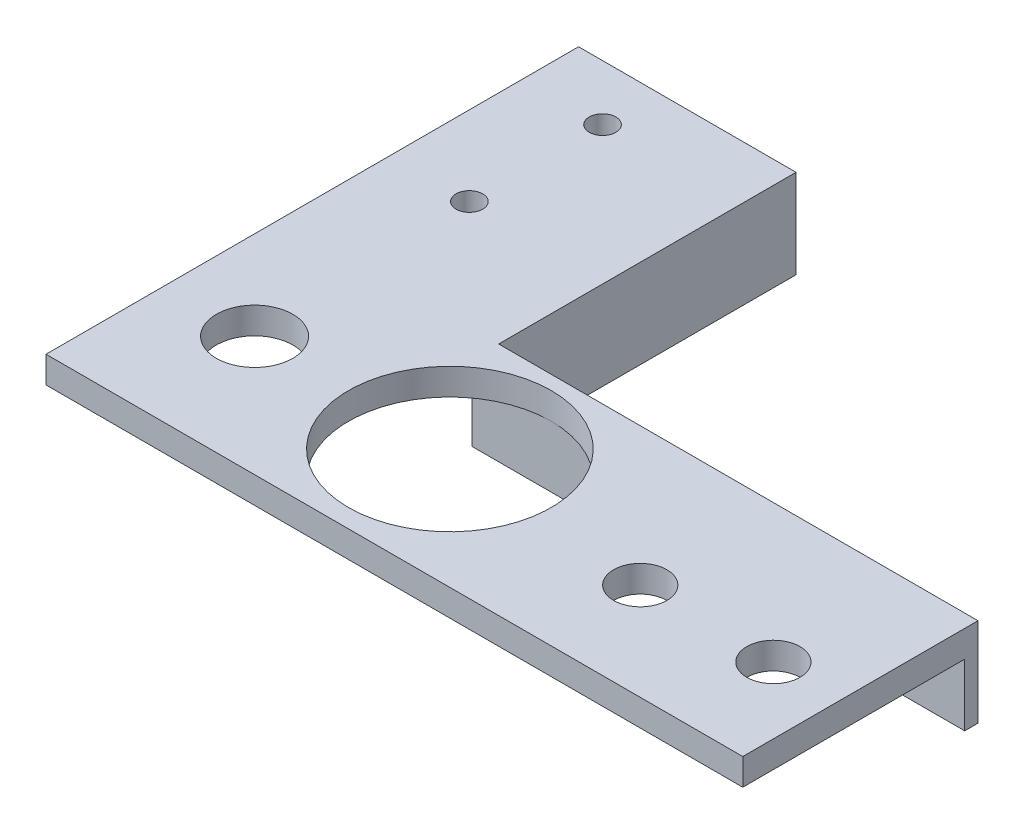
ISO-10303-21;
HEADER;
FILE_DESCRIPTION(('STEP AP214'),'2;1');
FILE_NAME('part.step','',(''),(''),'','','');
FILE_SCHEMA(('AUTOMOTIVE_DESIGN { 1 0 10303 214 1 1 1 1 }'));
ENDSEC;
DATA;
#1=APPLICATION_CONTEXT('core data for automotive mechanical design processes');
#2=APPLICATION_PROTOCOL_DEFINITION('international standard','automotive_design',2000,#1);
#3=PRODUCT_CONTEXT('',#1,'mechanical');
#4=PRODUCT('Part','Part','',(#3));
#5=PRODUCT_RELATED_PRODUCT_CATEGORY('part','',(#4));
#6=PRODUCT_DEFINITION_FORMATION('','',#4);
#7=PRODUCT_DEFINITION_CONTEXT('part definition',#1,'design');
#8=PRODUCT_DEFINITION('design','',#6,#7);
#9=PRODUCT_DEFINITION_SHAPE('','',#8);
#10=(LENGTH_UNIT() NAMED_UNIT(*) SI_UNIT(.MILLI.,.METRE.));
#11=(NAMED_UNIT(*) PLANE_ANGLE_UNIT() SI_UNIT($,.RADIAN.));
#12=(NAMED_UNIT(*) SI_UNIT($,.STERADIAN.) SOLID_ANGLE_UNIT());
#13=UNCERTAINTY_MEASURE_WITH_UNIT(LENGTH_MEASURE(1.E-05),#10,'distance_accuracy_value','');
#14=(GEOMETRIC_REPRESENTATION_CONTEXT(3) GLOBAL_UNCERTAINTY_ASSIGNED_CONTEXT((#13)) GLOBAL_UNIT_ASSIGNED_CONTEXT((#10,
#11,#12)) REPRESENTATION_CONTEXT('',''));
#15=CARTESIAN_POINT('',(0.,0.,0.));
#16=DIRECTION('',(0.,0.,1.));
#17=DIRECTION('',(1.,0.,0.));
#18=AXIS2_PLACEMENT_3D('',#15,#16,#17);
#19=CARTESIAN_POINT('',(39.25,3.,29.));
#20=DIRECTION('',(-1.,0.,0.));
#21=DIRECTION('',(0.,0.,1.));
#22=AXIS2_PLACEMENT_3D('',#19,#20,#21);
#23=PLANE('',#22);
#24=DIRECTION('',(0.,0.,-1.));
#25=VECTOR('',#24,1.);
#26=CARTESIAN_POINT('',(39.25,0.,29.));
#27=LINE('',#26,#25);
#28=CARTESIAN_POINT('',(39.25,0.,31.));
#29=VERTEX_POINT('',#28);
#30=CARTESIAN_POINT('',(39.25,0.,6.));
#31=VERTEX_POINT('',#30);
#32=EDGE_CURVE('E86',#29,#31,#27,.T.);
#33=ORIENTED_EDGE('',*,*,#32,.T.);
#34=DIRECTION('',(0.,1.,0.));
#35=VECTOR('',#34,1.);
#36=CARTESIAN_POINT('',(39.25,-7.,6.));
#37=LINE('',#36,#35);
#38=CARTESIAN_POINT('',(39.25,-7.,6.));
#39=VERTEX_POINT('',#38);
#40=EDGE_CURVE('E85',#39,#31,#37,.T.);
#41=ORIENTED_EDGE('',*,*,#40,.F.);
#42=DIRECTION('',(0.,0.,-1.));
#43=VECTOR('',#42,1.);
#44=CARTESIAN_POINT('',(39.25,-7.,6.));
#45=LINE('',#44,#43);
#46=CARTESIAN_POINT('',(39.25,-7.,4.5));
#47=VERTEX_POINT('',#46);
#48=EDGE_CURVE('E159',#39,#47,#45,.T.);
#49=ORIENTED_EDGE('',*,*,#48,.T.);
#50=DIRECTION('',(0.,1.,0.));
#51=VECTOR('',#50,1.);
#52=CARTESIAN_POINT('',(39.25,-7.,4.5));
#53=LINE('',#52,#51);
#54=CARTESIAN_POINT('',(39.25,3.,4.5));
#55=VERTEX_POINT('',#54);
#56=EDGE_CURVE('E94',#47,#55,#53,.T.);
#57=ORIENTED_EDGE('',*,*,#56,.T.);
#58=DIRECTION('',(0.,0.,-1.));
#59=VECTOR('',#58,1.);
#60=CARTESIAN_POINT('',(39.25,3.,29.));
#61=LINE('',#60,#59);
#62=CARTESIAN_POINT('',(39.25,3.,31.));
#63=VERTEX_POINT('',#62);
#64=EDGE_CURVE('E125',#63,#55,#61,.T.);
#65=ORIENTED_EDGE('',*,*,#64,.F.);
#66=DIRECTION('',(0.,1.,0.));
#67=VECTOR('',#66,1.);
#68=CARTESIAN_POINT('',(39.25,0.,31.));
#69=LINE('',#68,#67);
#70=EDGE_CURVE('E149',#29,#63,#69,.T.);
#71=ORIENTED_EDGE('',*,*,#70,.F.);
#72=EDGE_LOOP('',(#33,#41,#49,#57,#65,#71));
#73=FACE_BOUND('',#72,.T.);
#74=ADVANCED_FACE('F32',(#73),#23,.F.);
#75=CARTESIAN_POINT('',(-16.25,3.,-29.));
#76=DIRECTION('',(0.,0.,1.));
#77=DIRECTION('',(1.,0.,0.));
#78=AXIS2_PLACEMENT_3D('',#75,#76,#77);
#79=PLANE('',#78);
#80=DIRECTION('',(-1.,0.,0.));
#81=VECTOR('',#80,1.);
#82=CARTESIAN_POINT('',(-16.25,0.,-29.));
#83=LINE('',#82,#81);
#84=CARTESIAN_POINT('',(-16.25,0.,-29.));
#85=VERTEX_POINT('',#84);
#86=CARTESIAN_POINT('',(-39.25,0.,-29.));
#87=VERTEX_POINT('',#86);
#88=EDGE_CURVE('E71',#85,#87,#83,.T.);
#89=ORIENTED_EDGE('',*,*,#88,.T.);
#90=DIRECTION('',(0.,-1.,0.));
#91=VECTOR('',#90,1.);
#92=CARTESIAN_POINT('',(-39.25,3.,-29.));
#93=LINE('',#92,#91);
#94=CARTESIAN_POINT('',(-39.25,3.,-29.));
#95=VERTEX_POINT('',#94);
#96=EDGE_CURVE('E11',#95,#87,#93,.T.);
#97=ORIENTED_EDGE('',*,*,#96,.F.);
#98=DIRECTION('',(-1.,0.,0.));
#99=VECTOR('',#98,1.);
#100=CARTESIAN_POINT('',(-16.25,3.,-29.));
#101=LINE('',#100,#99);
#102=CARTESIAN_POINT('',(-14.75,3.,-29.));
#103=VERTEX_POINT('',#102);
#104=EDGE_CURVE('E49',#103,#95,#101,.T.);
#105=ORIENTED_EDGE('',*,*,#104,.F.);
#106=DIRECTION('',(0.,1.,0.));
#107=VECTOR('',#106,1.);
#108=CARTESIAN_POINT('',(-14.75,-7.,-29.));
#109=LINE('',#108,#107);
#110=CARTESIAN_POINT('',(-14.75,-7.,-29.));
#111=VERTEX_POINT('',#110);
#112=EDGE_CURVE('E107',#111,#103,#109,.T.);
#113=ORIENTED_EDGE('',*,*,#112,.F.);
#114=DIRECTION('',(-1.,0.,0.));
#115=VECTOR('',#114,1.);
#116=CARTESIAN_POINT('',(-14.75,-7.,-29.));
#117=LINE('',#116,#115);
#118=CARTESIAN_POINT('',(-16.25,-7.,-29.));
#119=VERTEX_POINT('',#118);
#120=EDGE_CURVE('E153',#111,#119,#117,.T.);
#121=ORIENTED_EDGE('',*,*,#120,.T.);
#122=DIRECTION('',(0.,1.,0.));
#123=VECTOR('',#122,1.);
#124=CARTESIAN_POINT('',(-16.25,-7.,-29.));
#125=LINE('',#124,#123);
#126=EDGE_CURVE('E92',#119,#85,#125,.T.);
#127=ORIENTED_EDGE('',*,*,#126,.T.);
#128=EDGE_LOOP('',(#89,#97,#105,#113,#121,#127));
#129=FACE_BOUND('',#128,.T.);
#130=ADVANCED_FACE('F204',(#129),#79,.F.);
#131=CARTESIAN_POINT('',(-39.25,3.,-29.));
#132=DIRECTION('',(1.,0.,0.));
#133=DIRECTION('',(0.,0.,-1.));
#134=AXIS2_PLACEMENT_3D('',#131,#132,#133);
#135=PLANE('',#134);
#136=DIRECTION('',(0.,0.,1.));
#137=VECTOR('',#136,1.);
#138=CARTESIAN_POINT('',(-39.25,0.,-29.));
#139=LINE('',#138,#137);
#140=CARTESIAN_POINT('',(-39.25,0.,31.));
#141=VERTEX_POINT('',#140);
#142=EDGE_CURVE('E128',#87,#141,#139,.T.);
#143=ORIENTED_EDGE('',*,*,#142,.T.);
#144=DIRECTION('',(0.,-1.,0.));
#145=VECTOR('',#144,1.);
#146=CARTESIAN_POINT('',(-39.25,0.,31.));
#147=LINE('',#146,#145);
#148=CARTESIAN_POINT('',(-39.25,3.,31.));
#149=VERTEX_POINT('',#148);
#150=EDGE_CURVE('E226',#149,#141,#147,.T.);
#151=ORIENTED_EDGE('',*,*,#150,.F.);
#152=DIRECTION('',(0.,0.,1.));
#153=VECTOR('',#152,1.);
#154=CARTESIAN_POINT('',(-39.25,3.,-29.));
#155=LINE('',#154,#153);
#156=EDGE_CURVE('E41',#95,#149,#155,.T.);
#157=ORIENTED_EDGE('',*,*,#156,.F.);
#158=ORIENTED_EDGE('',*,*,#96,.T.);
#159=EDGE_LOOP('',(#143,#151,#157,#158));
#160=FACE_BOUND('',#159,.T.);
#161=ADVANCED_FACE('F250',(#160),#135,.F.);
#162=CARTESIAN_POINT('',(0.,3.,0.));
#163=DIRECTION('',(0.,1.,0.));
#164=DIRECTION('',(0.,0.,1.));
#165=AXIS2_PLACEMENT_3D('',#162,#163,#164);
#166=PLANE('',#165);
#167=CARTESIAN_POINT('',(-29.2499999999999,3.,17.5));
#168=DIRECTION('',(0.,1.,0.));
#169=DIRECTION('',(0.,0.,1.));
#170=AXIS2_PLACEMENT_3D('',#167,#168,#169);
#171=CIRCLE('',#170,4.30465448526568);
#172=CARTESIAN_POINT('',(-29.2499999999999,3.,21.8046544852657));
#173=VERTEX_POINT('',#172);
#174=EDGE_CURVE('E230',#173,#173,#171,.T.);
#175=ORIENTED_EDGE('',*,*,#174,.F.);
#176=EDGE_LOOP('',(#175));
#177=FACE_BOUND('',#176,.T.);
#178=CARTESIAN_POINT('',(-7.25000000000003,3.,17.4999999999999));
#179=DIRECTION('',(0.,1.,0.));
#180=DIRECTION('',(0.,0.,1.));
#181=AXIS2_PLACEMENT_3D('',#178,#179,#180);
#182=CIRCLE('',#181,11.4206212485819);
#183=CARTESIAN_POINT('',(-7.25000000000003,3.,28.9206212485818));
#184=VERTEX_POINT('',#183);
#185=EDGE_CURVE('E137',#184,#184,#182,.T.);
#186=ORIENTED_EDGE('',*,*,#185,.F.);
#187=EDGE_LOOP('',(#186));
#188=FACE_BOUND('',#187,.T.);
#189=CARTESIAN_POINT('',(-30.3,3.,-7.75));
#190=DIRECTION('',(0.,1.,0.));
#191=DIRECTION('',(0.,0.,1.));
#192=AXIS2_PLACEMENT_3D('',#189,#190,#191);
#193=CIRCLE('',#192,1.5);
#194=CARTESIAN_POINT('',(-30.3,3.,-6.25));
#195=VERTEX_POINT('',#194);
#196=EDGE_CURVE('E104',#195,#195,#193,.T.);
#197=ORIENTED_EDGE('',*,*,#196,.F.);
#198=EDGE_LOOP('',(#197));
#199=FACE_BOUND('',#198,.T.);
#200=CARTESIAN_POINT('',(-30.3,3.,-22.75));
#201=DIRECTION('',(0.,1.,0.));
#202=DIRECTION('',(0.,0.,1.));
#203=AXIS2_PLACEMENT_3D('',#200,#201,#202);
#204=CIRCLE('',#203,1.5);
#205=CARTESIAN_POINT('',(-30.3,3.,-21.25));
#206=VERTEX_POINT('',#205);
#207=EDGE_CURVE('E103',#206,#206,#204,.T.);
#208=ORIENTED_EDGE('',*,*,#207,.F.);
#209=EDGE_LOOP('',(#208));
#210=FACE_BOUND('',#209,.T.);
#211=CARTESIAN_POINT('',(16.75,3.,20.05));
#212=DIRECTION('',(0.,1.,0.));
#213=DIRECTION('',(0.,0.,1.));
#214=AXIS2_PLACEMENT_3D('',#211,#212,#213);
#215=CIRCLE('',#214,3.);
#216=CARTESIAN_POINT('',(16.75,3.,23.05));
#217=VERTEX_POINT('',#216);
#218=EDGE_CURVE('E111',#217,#217,#215,.T.);
#219=ORIENTED_EDGE('',*,*,#218,.F.);
#220=EDGE_LOOP('',(#219));
#221=FACE_BOUND('',#220,.T.);
#222=CARTESIAN_POINT('',(31.75,3.,20.05));
#223=DIRECTION('',(0.,1.,0.));
#224=DIRECTION('',(0.,0.,1.));
#225=AXIS2_PLACEMENT_3D('',#222,#223,#224);
#226=CIRCLE('',#225,3.);
#227=CARTESIAN_POINT('',(31.75,3.,23.05));
#228=VERTEX_POINT('',#227);
#229=EDGE_CURVE('E117',#228,#228,#226,.T.);
#230=ORIENTED_EDGE('',*,*,#229,.F.);
#231=EDGE_LOOP('',(#230));
#232=FACE_BOUND('',#231,.T.);
#233=ORIENTED_EDGE('',*,*,#156,.T.);
#234=DIRECTION('',(-1.,0.,0.));
#235=VECTOR('',#234,1.);
#236=CARTESIAN_POINT('',(-39.25,3.,31.));
#237=LINE('',#236,#235);
#238=EDGE_CURVE('E144',#63,#149,#237,.T.);
#239=ORIENTED_EDGE('',*,*,#238,.F.);
#240=ORIENTED_EDGE('',*,*,#64,.T.);
#241=DIRECTION('',(-1.,0.,0.));
#242=VECTOR('',#241,1.);
#243=CARTESIAN_POINT('',(39.25,3.,4.5));
#244=LINE('',#243,#242);
#245=CARTESIAN_POINT('',(-14.75,3.,4.50000000000001));
#246=VERTEX_POINT('',#245);
#247=EDGE_CURVE('E136',#55,#246,#244,.T.);
#248=ORIENTED_EDGE('',*,*,#247,.T.);
#249=DIRECTION('',(0.,0.,-1.));
#250=VECTOR('',#249,1.);
#251=CARTESIAN_POINT('',(-14.75,3.,4.50000000000001));
#252=LINE('',#251,#250);
#253=EDGE_CURVE('E141',#246,#103,#252,.T.);
#254=ORIENTED_EDGE('',*,*,#253,.T.);
#255=ORIENTED_EDGE('',*,*,#104,.T.);
#256=EDGE_LOOP('',(#233,#239,#240,#248,#254,#255));
#257=FACE_BOUND('',#256,.T.);
#258=ADVANCED_FACE('F191',(#177,#188,#199,#210,#221,#232,#257),#166,.T.);
#259=CARTESIAN_POINT('',(0.,0.,0.));
#260=DIRECTION('',(0.,1.,0.));
#261=DIRECTION('',(0.,0.,1.));
#262=AXIS2_PLACEMENT_3D('',#259,#260,#261);
#263=PLANE('',#262);
#264=CARTESIAN_POINT('',(-29.2499999999999,0.,17.5));
#265=DIRECTION('',(0.,1.,0.));
#266=DIRECTION('',(0.,0.,1.));
#267=AXIS2_PLACEMENT_3D('',#264,#265,#266);
#268=CIRCLE('',#267,4.30465448526568);
#269=CARTESIAN_POINT('',(-29.2499999999999,0.,21.8046544852657));
#270=VERTEX_POINT('',#269);
#271=EDGE_CURVE('E35',#270,#270,#268,.T.);
#272=ORIENTED_EDGE('',*,*,#271,.T.);
#273=EDGE_LOOP('',(#272));
#274=FACE_BOUND('',#273,.T.);
#275=CARTESIAN_POINT('',(-7.25000000000003,0.,17.4999999999999));
#276=DIRECTION('',(0.,1.,0.));
#277=DIRECTION('',(0.,0.,1.));
#278=AXIS2_PLACEMENT_3D('',#275,#276,#277);
#279=CIRCLE('',#278,11.4206212485819);
#280=CARTESIAN_POINT('',(-7.25000000000003,0.,28.9206212485818));
#281=VERTEX_POINT('',#280);
#282=EDGE_CURVE('E134',#281,#281,#279,.T.);
#283=ORIENTED_EDGE('',*,*,#282,.T.);
#284=EDGE_LOOP('',(#283));
#285=FACE_BOUND('',#284,.T.);
#286=CARTESIAN_POINT('',(-30.3,0.,-7.75));
#287=DIRECTION('',(0.,1.,0.));
#288=DIRECTION('',(0.,0.,1.));
#289=AXIS2_PLACEMENT_3D('',#286,#287,#288);
#290=CIRCLE('',#289,1.5);
#291=CARTESIAN_POINT('',(-30.3,0.,-6.25));
#292=VERTEX_POINT('',#291);
#293=EDGE_CURVE('E100',#292,#292,#290,.T.);
#294=ORIENTED_EDGE('',*,*,#293,.T.);
#295=EDGE_LOOP('',(#294));
#296=FACE_BOUND('',#295,.T.);
#297=CARTESIAN_POINT('',(-30.3,0.,-22.75));
#298=DIRECTION('',(0.,1.,0.));
#299=DIRECTION('',(0.,0.,1.));
#300=AXIS2_PLACEMENT_3D('',#297,#298,#299);
#301=CIRCLE('',#300,1.5);
#302=CARTESIAN_POINT('',(-30.3,0.,-21.25));
#303=VERTEX_POINT('',#302);
#304=EDGE_CURVE('E108',#303,#303,#301,.T.);
#305=ORIENTED_EDGE('',*,*,#304,.T.);
#306=EDGE_LOOP('',(#305));
#307=FACE_BOUND('',#306,.T.);
#308=CARTESIAN_POINT('',(16.75,0.,20.05));
#309=DIRECTION('',(0.,1.,0.));
#310=DIRECTION('',(0.,0.,1.));
#311=AXIS2_PLACEMENT_3D('',#308,#309,#310);
#312=CIRCLE('',#311,3.);
#313=CARTESIAN_POINT('',(16.75,0.,23.05));
#314=VERTEX_POINT('',#313);
#315=EDGE_CURVE('E114',#314,#314,#312,.T.);
#316=ORIENTED_EDGE('',*,*,#315,.T.);
#317=EDGE_LOOP('',(#316));
#318=FACE_BOUND('',#317,.T.);
#319=CARTESIAN_POINT('',(31.75,0.,20.05));
#320=DIRECTION('',(0.,1.,0.));
#321=DIRECTION('',(0.,0.,1.));
#322=AXIS2_PLACEMENT_3D('',#319,#320,#321);
#323=CIRCLE('',#322,3.);
#324=CARTESIAN_POINT('',(31.75,0.,23.05));
#325=VERTEX_POINT('',#324);
#326=EDGE_CURVE('E120',#325,#325,#323,.T.);
#327=ORIENTED_EDGE('',*,*,#326,.T.);
#328=EDGE_LOOP('',(#327));
#329=FACE_BOUND('',#328,.T.);
#330=ORIENTED_EDGE('',*,*,#32,.F.);
#331=DIRECTION('',(1.,0.,0.));
#332=VECTOR('',#331,1.);
#333=CARTESIAN_POINT('',(-39.25,0.,31.));
#334=LINE('',#333,#332);
#335=EDGE_CURVE('E220',#141,#29,#334,.T.);
#336=ORIENTED_EDGE('',*,*,#335,.F.);
#337=ORIENTED_EDGE('',*,*,#142,.F.);
#338=ORIENTED_EDGE('',*,*,#88,.F.);
#339=DIRECTION('',(0.,0.,-1.));
#340=VECTOR('',#339,1.);
#341=CARTESIAN_POINT('',(-16.25,0.,-29.));
#342=LINE('',#341,#340);
#343=CARTESIAN_POINT('',(-16.25,0.,6.));
#344=VERTEX_POINT('',#343);
#345=EDGE_CURVE('E64',#344,#85,#342,.T.);
#346=ORIENTED_EDGE('',*,*,#345,.F.);
#347=DIRECTION('',(-1.,0.,0.));
#348=VECTOR('',#347,1.);
#349=CARTESIAN_POINT('',(-16.25,0.,6.));
#350=LINE('',#349,#348);
#351=EDGE_CURVE('E68',#31,#344,#350,.T.);
#352=ORIENTED_EDGE('',*,*,#351,.F.);
#353=EDGE_LOOP('',(#330,#336,#337,#338,#346,#352));
#354=FACE_BOUND('',#353,.T.);
#355=ADVANCED_FACE('F67',(#274,#285,#296,#307,#318,#329,#354),#263,.F.);
#356=CARTESIAN_POINT('',(31.75,0.,20.05));
#357=DIRECTION('',(0.,1.,0.));
#358=DIRECTION('',(0.,0.,1.));
#359=AXIS2_PLACEMENT_3D('',#356,#357,#358);
#360=CYLINDRICAL_SURFACE('',#359,3.);
#361=ORIENTED_EDGE('',*,*,#326,.F.);
#362=EDGE_LOOP('',(#361));
#363=FACE_BOUND('',#362,.T.);
#364=ORIENTED_EDGE('',*,*,#229,.T.);
#365=EDGE_LOOP('',(#364));
#366=FACE_BOUND('',#365,.T.);
#367=ADVANCED_FACE('F259',(#363,#366),#360,.F.);
#368=CARTESIAN_POINT('',(16.75,0.,20.05));
#369=DIRECTION('',(0.,1.,0.));
#370=DIRECTION('',(0.,0.,1.));
#371=AXIS2_PLACEMENT_3D('',#368,#369,#370);
#372=CYLINDRICAL_SURFACE('',#371,3.);
#373=ORIENTED_EDGE('',*,*,#315,.F.);
#374=EDGE_LOOP('',(#373));
#375=FACE_BOUND('',#374,.T.);
#376=ORIENTED_EDGE('',*,*,#218,.T.);
#377=EDGE_LOOP('',(#376));
#378=FACE_BOUND('',#377,.T.);
#379=ADVANCED_FACE('F265',(#375,#378),#372,.F.);
#380=CARTESIAN_POINT('',(-30.3,0.,-22.75));
#381=DIRECTION('',(0.,1.,0.));
#382=DIRECTION('',(0.,0.,1.));
#383=AXIS2_PLACEMENT_3D('',#380,#381,#382);
#384=CYLINDRICAL_SURFACE('',#383,1.5);
#385=ORIENTED_EDGE('',*,*,#304,.F.);
#386=EDGE_LOOP('',(#385));
#387=FACE_BOUND('',#386,.T.);
#388=ORIENTED_EDGE('',*,*,#207,.T.);
#389=EDGE_LOOP('',(#388));
#390=FACE_BOUND('',#389,.T.);
#391=ADVANCED_FACE('F269',(#387,#390),#384,.F.);
#392=CARTESIAN_POINT('',(-30.3,0.,-7.75));
#393=DIRECTION('',(0.,1.,0.));
#394=DIRECTION('',(0.,0.,1.));
#395=AXIS2_PLACEMENT_3D('',#392,#393,#394);
#396=CYLINDRICAL_SURFACE('',#395,1.5);
#397=ORIENTED_EDGE('',*,*,#293,.F.);
#398=EDGE_LOOP('',(#397));
#399=FACE_BOUND('',#398,.T.);
#400=ORIENTED_EDGE('',*,*,#196,.T.);
#401=EDGE_LOOP('',(#400));
#402=FACE_BOUND('',#401,.T.);
#403=ADVANCED_FACE('F273',(#399,#402),#396,.F.);
#404=CARTESIAN_POINT('',(-16.25,-7.,6.));
#405=DIRECTION('',(0.,0.,1.));
#406=DIRECTION('',(1.,0.,0.));
#407=AXIS2_PLACEMENT_3D('',#404,#405,#406);
#408=PLANE('',#407);
#409=ORIENTED_EDGE('',*,*,#351,.T.);
#410=DIRECTION('',(0.,1.,0.));
#411=VECTOR('',#410,1.);
#412=CARTESIAN_POINT('',(-16.25,-7.,6.));
#413=LINE('',#412,#411);
#414=CARTESIAN_POINT('',(-16.25,-7.,6.));
#415=VERTEX_POINT('',#414);
#416=EDGE_CURVE('E82',#415,#344,#413,.T.);
#417=ORIENTED_EDGE('',*,*,#416,.F.);
#418=DIRECTION('',(1.,0.,0.));
#419=VECTOR('',#418,1.);
#420=CARTESIAN_POINT('',(-16.25,-7.,6.));
#421=LINE('',#420,#419);
#422=EDGE_CURVE('E157',#415,#39,#421,.T.);
#423=ORIENTED_EDGE('',*,*,#422,.T.);
#424=ORIENTED_EDGE('',*,*,#40,.T.);
#425=EDGE_LOOP('',(#409,#417,#423,#424));
#426=FACE_BOUND('',#425,.T.);
#427=ADVANCED_FACE('F79',(#426),#408,.T.);
#428=CARTESIAN_POINT('',(-16.25,-7.,-29.));
#429=DIRECTION('',(-1.,0.,0.));
#430=DIRECTION('',(0.,0.,1.));
#431=AXIS2_PLACEMENT_3D('',#428,#429,#430);
#432=PLANE('',#431);
#433=ORIENTED_EDGE('',*,*,#345,.T.);
#434=ORIENTED_EDGE('',*,*,#126,.F.);
#435=DIRECTION('',(0.,0.,1.));
#436=VECTOR('',#435,1.);
#437=CARTESIAN_POINT('',(-16.25,-7.,-29.));
#438=LINE('',#437,#436);
#439=EDGE_CURVE('E91',#119,#415,#438,.T.);
#440=ORIENTED_EDGE('',*,*,#439,.T.);
#441=ORIENTED_EDGE('',*,*,#416,.T.);
#442=EDGE_LOOP('',(#433,#434,#440,#441));
#443=FACE_BOUND('',#442,.T.);
#444=ADVANCED_FACE('F89',(#443),#432,.T.);
#445=CARTESIAN_POINT('',(-14.75,-7.,4.50000000000001));
#446=DIRECTION('',(1.,0.,0.));
#447=DIRECTION('',(0.,0.,-1.));
#448=AXIS2_PLACEMENT_3D('',#445,#446,#447);
#449=PLANE('',#448);
#450=ORIENTED_EDGE('',*,*,#253,.F.);
#451=DIRECTION('',(0.,1.,0.));
#452=VECTOR('',#451,1.);
#453=CARTESIAN_POINT('',(-14.75,-7.,4.50000000000001));
#454=LINE('',#453,#452);
#455=CARTESIAN_POINT('',(-14.75,-7.,4.50000000000001));
#456=VERTEX_POINT('',#455);
#457=EDGE_CURVE('E170',#456,#246,#454,.T.);
#458=ORIENTED_EDGE('',*,*,#457,.F.);
#459=DIRECTION('',(0.,0.,-1.));
#460=VECTOR('',#459,1.);
#461=CARTESIAN_POINT('',(-14.75,-7.,4.50000000000001));
#462=LINE('',#461,#460);
#463=EDGE_CURVE('E96',#456,#111,#462,.T.);
#464=ORIENTED_EDGE('',*,*,#463,.T.);
#465=ORIENTED_EDGE('',*,*,#112,.T.);
#466=EDGE_LOOP('',(#450,#458,#464,#465));
#467=FACE_BOUND('',#466,.T.);
#468=ADVANCED_FACE('F196',(#467),#449,.T.);
#469=CARTESIAN_POINT('',(39.25,-7.,4.5));
#470=DIRECTION('',(0.,0.,-1.));
#471=DIRECTION('',(-1.,0.,0.));
#472=AXIS2_PLACEMENT_3D('',#469,#470,#471);
#473=PLANE('',#472);
#474=ORIENTED_EDGE('',*,*,#247,.F.);
#475=ORIENTED_EDGE('',*,*,#56,.F.);
#476=DIRECTION('',(-1.,0.,0.));
#477=VECTOR('',#476,1.);
#478=CARTESIAN_POINT('',(39.25,-7.,4.5));
#479=LINE('',#478,#477);
#480=EDGE_CURVE('E162',#47,#456,#479,.T.);
#481=ORIENTED_EDGE('',*,*,#480,.T.);
#482=ORIENTED_EDGE('',*,*,#457,.T.);
#483=EDGE_LOOP('',(#474,#475,#481,#482));
#484=FACE_BOUND('',#483,.T.);
#485=ADVANCED_FACE('F188',(#484),#473,.T.);
#486=CARTESIAN_POINT('',(0.,-7.,0.));
#487=DIRECTION('',(0.,1.,0.));
#488=DIRECTION('',(0.,0.,1.));
#489=AXIS2_PLACEMENT_3D('',#486,#487,#488);
#490=PLANE('',#489);
#491=ORIENTED_EDGE('',*,*,#120,.F.);
#492=ORIENTED_EDGE('',*,*,#463,.F.);
#493=ORIENTED_EDGE('',*,*,#480,.F.);
#494=ORIENTED_EDGE('',*,*,#48,.F.);
#495=ORIENTED_EDGE('',*,*,#422,.F.);
#496=ORIENTED_EDGE('',*,*,#439,.F.);
#497=EDGE_LOOP('',(#491,#492,#493,#494,#495,#496));
#498=FACE_BOUND('',#497,.T.);
#499=ADVANCED_FACE('F207',(#498),#490,.F.);
#500=CARTESIAN_POINT('',(-7.25000000000003,-7.,17.4999999999999));
#501=DIRECTION('',(0.,1.,0.));
#502=DIRECTION('',(0.,0.,1.));
#503=AXIS2_PLACEMENT_3D('',#500,#501,#502);
#504=CYLINDRICAL_SURFACE('',#503,11.4206212485819);
#505=ORIENTED_EDGE('',*,*,#185,.T.);
#506=EDGE_LOOP('',(#505));
#507=FACE_BOUND('',#506,.T.);
#508=ORIENTED_EDGE('',*,*,#282,.F.);
#509=EDGE_LOOP('',(#508));
#510=FACE_BOUND('',#509,.T.);
#511=ADVANCED_FACE('F244',(#507,#510),#504,.F.);
#512=CARTESIAN_POINT('',(0.,0.,31.));
#513=DIRECTION('',(0.,0.,-1.));
#514=DIRECTION('',(-1.,0.,0.));
#515=AXIS2_PLACEMENT_3D('',#512,#513,#514);
#516=PLANE('',#515);
#517=ORIENTED_EDGE('',*,*,#150,.T.);
#518=ORIENTED_EDGE('',*,*,#335,.T.);
#519=ORIENTED_EDGE('',*,*,#70,.T.);
#520=ORIENTED_EDGE('',*,*,#238,.T.);
#521=EDGE_LOOP('',(#517,#518,#519,#520));
#522=FACE_BOUND('',#521,.T.);
#523=ADVANCED_FACE('F224',(#522),#516,.F.);
#524=CARTESIAN_POINT('',(-29.2499999999999,-7.,17.5));
#525=DIRECTION('',(0.,1.,0.));
#526=DIRECTION('',(0.,0.,1.));
#527=AXIS2_PLACEMENT_3D('',#524,#525,#526);
#528=CYLINDRICAL_SURFACE('',#527,4.30465448526568);
#529=ORIENTED_EDGE('',*,*,#174,.T.);
#530=EDGE_LOOP('',(#529));
#531=FACE_BOUND('',#530,.T.);
#532=ORIENTED_EDGE('',*,*,#271,.F.);
#533=EDGE_LOOP('',(#532));
#534=FACE_BOUND('',#533,.T.);
#535=ADVANCED_FACE('F238',(#531,#534),#528,.F.);
#536=CLOSED_SHELL('',(#74,#130,#161,#258,#355,#367,#379,#391,#403,#427,#444,#468,#485,#499,#511,
#523,#535));
#537=MANIFOLD_SOLID_BREP('B2',#536);
#538=ADVANCED_BREP_SHAPE_REPRESENTATION('',(#18,#537),#14);
#539=SHAPE_DEFINITION_REPRESENTATION(#9,#538);
ENDSEC;
END-ISO-10303-21;
